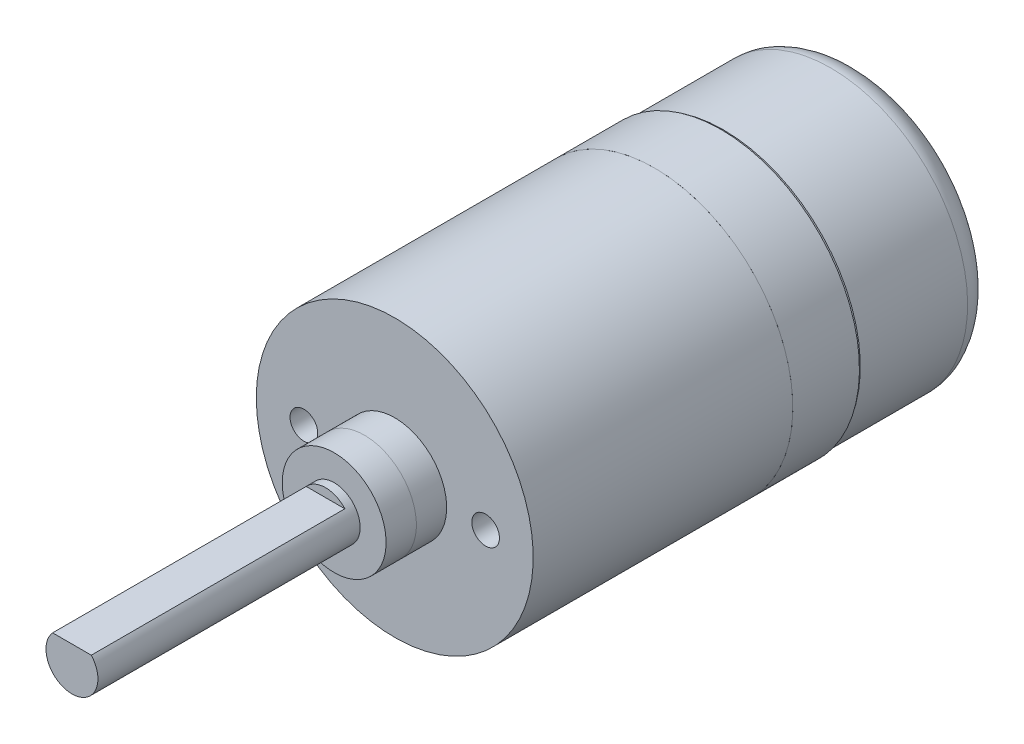
ISO-10303-21;
HEADER;
FILE_DESCRIPTION(('STEP AP214'),'2;1');
FILE_NAME('part.step','',(''),(''),'','','');
FILE_SCHEMA(('AUTOMOTIVE_DESIGN { 1 0 10303 214 1 1 1 1 }'));
ENDSEC;
DATA;
#1=APPLICATION_CONTEXT('core data for automotive mechanical design processes');
#2=APPLICATION_PROTOCOL_DEFINITION('international standard','automotive_design',2000,#1);
#3=PRODUCT_CONTEXT('',#1,'mechanical');
#4=PRODUCT('Part','Part','',(#3));
#5=PRODUCT_RELATED_PRODUCT_CATEGORY('part','',(#4));
#6=PRODUCT_DEFINITION_FORMATION('','',#4);
#7=PRODUCT_DEFINITION_CONTEXT('part definition',#1,'design');
#8=PRODUCT_DEFINITION('design','',#6,#7);
#9=PRODUCT_DEFINITION_SHAPE('','',#8);
#10=(LENGTH_UNIT() NAMED_UNIT(*) SI_UNIT(.MILLI.,.METRE.));
#11=(NAMED_UNIT(*) PLANE_ANGLE_UNIT() SI_UNIT($,.RADIAN.));
#12=(NAMED_UNIT(*) SI_UNIT($,.STERADIAN.) SOLID_ANGLE_UNIT());
#13=UNCERTAINTY_MEASURE_WITH_UNIT(LENGTH_MEASURE(1.E-05),#10,'distance_accuracy_value','');
#14=(GEOMETRIC_REPRESENTATION_CONTEXT(3) GLOBAL_UNCERTAINTY_ASSIGNED_CONTEXT((#13)) GLOBAL_UNIT_ASSIGNED_CONTEXT((#10,
#11,#12)) REPRESENTATION_CONTEXT('',''));
#15=CARTESIAN_POINT('',(0.,0.,0.));
#16=DIRECTION('',(0.,0.,1.));
#17=DIRECTION('',(1.,0.,0.));
#18=AXIS2_PLACEMENT_3D('',#15,#16,#17);
#19=CARTESIAN_POINT('',(-1.11803398874988,1.,19.));
#20=DIRECTION('',(0.,-1.,0.));
#21=DIRECTION('',(0.,0.,-1.));
#22=AXIS2_PLACEMENT_3D('',#19,#20,#21);
#23=PLANE('',#22);
#24=DIRECTION('',(-1.,0.,0.));
#25=VECTOR('',#24,1.);
#26=CARTESIAN_POINT('',(-1.11803398874988,1.,33.65));
#27=LINE('',#26,#25);
#28=CARTESIAN_POINT('',(1.11803398874989,1.00000000000001,33.65));
#29=VERTEX_POINT('',#28);
#30=CARTESIAN_POINT('',(-1.11803398874988,1.,33.65));
#31=VERTEX_POINT('',#30);
#32=EDGE_CURVE('P0_E62',#29,#31,#27,.T.);
#33=ORIENTED_EDGE('',*,*,#32,.F.);
#34=DIRECTION('',(0.,0.,1.));
#35=VECTOR('',#34,1.);
#36=CARTESIAN_POINT('',(1.11803398874988,1.,19.));
#37=LINE('',#36,#35);
#38=CARTESIAN_POINT('',(1.11803398874988,1.,19.));
#39=VERTEX_POINT('',#38);
#40=EDGE_CURVE('P0_E127',#39,#29,#37,.T.);
#41=ORIENTED_EDGE('',*,*,#40,.F.);
#42=DIRECTION('',(1.,0.,0.));
#43=VECTOR('',#42,1.);
#44=CARTESIAN_POINT('',(-1.11803398874988,1.,19.));
#45=LINE('',#44,#43);
#46=CARTESIAN_POINT('',(-1.11803398874988,1.,19.));
#47=VERTEX_POINT('',#46);
#48=EDGE_CURVE('P0_E147',#47,#39,#45,.T.);
#49=ORIENTED_EDGE('',*,*,#48,.F.);
#50=DIRECTION('',(0.,0.,1.));
#51=VECTOR('',#50,1.);
#52=CARTESIAN_POINT('',(-1.11803398874988,1.,19.));
#53=LINE('',#52,#51);
#54=EDGE_CURVE('P0_E129',#47,#31,#53,.T.);
#55=ORIENTED_EDGE('',*,*,#54,.T.);
#56=EDGE_LOOP('',(#33,#41,#49,#55));
#57=FACE_BOUND('',#56,.T.);
#58=ADVANCED_FACE('P0_F45',(#57),#23,.F.);
#59=CARTESIAN_POINT('',(0.,0.,0.));
#60=DIRECTION('',(0.,0.,-1.));
#61=DIRECTION('',(-1.,0.,0.));
#62=AXIS2_PLACEMENT_3D('',#59,#60,#61);
#63=CYLINDRICAL_SURFACE('',#62,1.5);
#64=CARTESIAN_POINT('',(0.,0.,18.5));
#65=DIRECTION('',(0.,0.,-1.));
#66=DIRECTION('',(-1.,0.,0.));
#67=AXIS2_PLACEMENT_3D('',#64,#65,#66);
#68=CIRCLE('',#67,1.5);
#69=CARTESIAN_POINT('',(-1.5,0.,18.5));
#70=VERTEX_POINT('',#69);
#71=EDGE_CURVE('P0_E152',#70,#70,#68,.T.);
#72=ORIENTED_EDGE('',*,*,#71,.F.);
#73=EDGE_LOOP('',(#72));
#74=FACE_BOUND('',#73,.T.);
#75=ORIENTED_EDGE('',*,*,#40,.T.);
#76=CARTESIAN_POINT('',(0.,0.,33.65));
#77=DIRECTION('',(0.,0.,1.));
#78=DIRECTION('',(1.,0.,0.));
#79=AXIS2_PLACEMENT_3D('',#76,#77,#78);
#80=CIRCLE('',#79,1.5);
#81=EDGE_CURVE('P0_E118',#31,#29,#80,.T.);
#82=ORIENTED_EDGE('',*,*,#81,.F.);
#83=ORIENTED_EDGE('',*,*,#54,.F.);
#84=CARTESIAN_POINT('',(0.,0.,19.));
#85=DIRECTION('',(0.,0.,1.));
#86=DIRECTION('',(1.,0.,0.));
#87=AXIS2_PLACEMENT_3D('',#84,#85,#86);
#88=CIRCLE('',#87,1.5);
#89=EDGE_CURVE('P0_E134',#39,#47,#88,.T.);
#90=ORIENTED_EDGE('',*,*,#89,.F.);
#91=EDGE_LOOP('',(#75,#82,#83,#90));
#92=FACE_BOUND('',#91,.T.);
#93=ADVANCED_FACE('P0_F132',(#74,#92),#63,.T.);
#94=CARTESIAN_POINT('',(-5.25,0.,15.));
#95=DIRECTION('',(0.,0.,1.));
#96=DIRECTION('',(1.,0.,0.));
#97=AXIS2_PLACEMENT_3D('',#94,#95,#96);
#98=CYLINDRICAL_SURFACE('',#97,0.8);
#99=CARTESIAN_POINT('',(-5.25,0.,12.5));
#100=DIRECTION('',(0.,0.,1.));
#101=DIRECTION('',(1.,0.,0.));
#102=AXIS2_PLACEMENT_3D('',#99,#100,#101);
#103=CIRCLE('',#102,0.8);
#104=CARTESIAN_POINT('',(-4.45,0.,12.5));
#105=VERTEX_POINT('',#104);
#106=EDGE_CURVE('P0_E11',#105,#105,#103,.T.);
#107=ORIENTED_EDGE('',*,*,#106,.F.);
#108=EDGE_LOOP('',(#107));
#109=FACE_BOUND('',#108,.T.);
#110=CARTESIAN_POINT('',(-5.25,0.,15.));
#111=DIRECTION('',(0.,0.,1.));
#112=DIRECTION('',(1.,0.,0.));
#113=AXIS2_PLACEMENT_3D('',#110,#111,#112);
#114=CIRCLE('',#113,0.8);
#115=CARTESIAN_POINT('',(-4.45,0.,15.));
#116=VERTEX_POINT('',#115);
#117=EDGE_CURVE('P0_E159',#116,#116,#114,.T.);
#118=ORIENTED_EDGE('',*,*,#117,.T.);
#119=EDGE_LOOP('',(#118));
#120=FACE_BOUND('',#119,.T.);
#121=ADVANCED_FACE('P0_F196',(#109,#120),#98,.F.);
#122=CARTESIAN_POINT('',(-5.25,0.,12.5));
#123=DIRECTION('',(0.,0.,1.));
#124=DIRECTION('',(1.,0.,0.));
#125=AXIS2_PLACEMENT_3D('',#122,#123,#124);
#126=CONICAL_SURFACE('',#125,0.8,1.02974425867665);
#127=CARTESIAN_POINT('',(-5.25,0.,12.0193115047779));
#128=VERTEX_POINT('',#127);
#129=VERTEX_LOOP('',#128);
#130=FACE_BOUND('',#129,.T.);
#131=ORIENTED_EDGE('',*,*,#106,.T.);
#132=EDGE_LOOP('',(#131));
#133=FACE_BOUND('',#132,.T.);
#134=ADVANCED_FACE('P0_F212',(#130,#133),#126,.F.);
#135=CARTESIAN_POINT('',(5.25,0.,15.));
#136=DIRECTION('',(0.,0.,1.));
#137=DIRECTION('',(1.,0.,0.));
#138=AXIS2_PLACEMENT_3D('',#135,#136,#137);
#139=CYLINDRICAL_SURFACE('',#138,0.8);
#140=CARTESIAN_POINT('',(5.25,0.,12.5));
#141=DIRECTION('',(0.,0.,1.));
#142=DIRECTION('',(1.,0.,0.));
#143=AXIS2_PLACEMENT_3D('',#140,#141,#142);
#144=CIRCLE('',#143,0.8);
#145=CARTESIAN_POINT('',(6.05,0.,12.5));
#146=VERTEX_POINT('',#145);
#147=EDGE_CURVE('P0_E55',#146,#146,#144,.T.);
#148=ORIENTED_EDGE('',*,*,#147,.F.);
#149=EDGE_LOOP('',(#148));
#150=FACE_BOUND('',#149,.T.);
#151=CARTESIAN_POINT('',(5.25,0.,15.));
#152=DIRECTION('',(0.,0.,1.));
#153=DIRECTION('',(1.,0.,0.));
#154=AXIS2_PLACEMENT_3D('',#151,#152,#153);
#155=CIRCLE('',#154,0.8);
#156=CARTESIAN_POINT('',(6.05,0.,15.));
#157=VERTEX_POINT('',#156);
#158=EDGE_CURVE('P0_E156',#157,#157,#155,.T.);
#159=ORIENTED_EDGE('',*,*,#158,.T.);
#160=EDGE_LOOP('',(#159));
#161=FACE_BOUND('',#160,.T.);
#162=ADVANCED_FACE('P0_F47',(#150,#161),#139,.F.);
#163=CARTESIAN_POINT('',(5.25,0.,12.5));
#164=DIRECTION('',(0.,0.,1.));
#165=DIRECTION('',(1.,0.,0.));
#166=AXIS2_PLACEMENT_3D('',#163,#164,#165);
#167=CONICAL_SURFACE('',#166,0.8,1.02974425867665);
#168=CARTESIAN_POINT('',(5.25,0.,12.0193115047779));
#169=VERTEX_POINT('',#168);
#170=VERTEX_LOOP('',#169);
#171=FACE_BOUND('',#170,.T.);
#172=ORIENTED_EDGE('',*,*,#147,.T.);
#173=EDGE_LOOP('',(#172));
#174=FACE_BOUND('',#173,.T.);
#175=ADVANCED_FACE('P0_F204',(#171,#174),#167,.F.);
#176=CARTESIAN_POINT('',(0.,0.,19.));
#177=DIRECTION('',(0.,0.,1.));
#178=DIRECTION('',(1.,0.,0.));
#179=AXIS2_PLACEMENT_3D('',#176,#177,#178);
#180=PLANE('',#179);
#181=ORIENTED_EDGE('',*,*,#89,.T.);
#182=ORIENTED_EDGE('',*,*,#48,.T.);
#183=EDGE_LOOP('',(#181,#182));
#184=FACE_BOUND('',#183,.T.);
#185=ADVANCED_FACE('P0_F201',(#184),#180,.T.);
#186=CARTESIAN_POINT('',(0.,8.,0.));
#187=DIRECTION('',(0.,0.,-1.));
#188=DIRECTION('',(0.,-1.,0.));
#189=AXIS2_PLACEMENT_3D('',#186,#187,#188);
#190=PLANE('',#189);
#191=CARTESIAN_POINT('',(0.,0.,0.));
#192=DIRECTION('',(0.,0.,-1.));
#193=DIRECTION('',(-1.,0.,0.));
#194=AXIS2_PLACEMENT_3D('',#191,#192,#193);
#195=CIRCLE('',#194,8.);
#196=CARTESIAN_POINT('',(-8.,0.,0.));
#197=VERTEX_POINT('',#196);
#198=EDGE_CURVE('P0_E150',#197,#197,#195,.T.);
#199=ORIENTED_EDGE('',*,*,#198,.T.);
#200=EDGE_LOOP('',(#199));
#201=FACE_BOUND('',#200,.T.);
#202=ADVANCED_FACE('P0_F203',(#201),#190,.T.);
#203=CARTESIAN_POINT('',(0.,0.,0.));
#204=DIRECTION('',(0.,0.,-1.));
#205=DIRECTION('',(-1.,0.,0.));
#206=AXIS2_PLACEMENT_3D('',#203,#204,#205);
#207=CYLINDRICAL_SURFACE('',#206,8.);
#208=CARTESIAN_POINT('',(0.,0.,15.));
#209=DIRECTION('',(0.,0.,-1.));
#210=DIRECTION('',(-1.,0.,0.));
#211=AXIS2_PLACEMENT_3D('',#208,#209,#210);
#212=CIRCLE('',#211,8.);
#213=CARTESIAN_POINT('',(-8.,0.,15.));
#214=VERTEX_POINT('',#213);
#215=EDGE_CURVE('P0_E49',#214,#214,#212,.T.);
#216=ORIENTED_EDGE('',*,*,#215,.T.);
#217=EDGE_LOOP('',(#216));
#218=FACE_BOUND('',#217,.T.);
#219=ORIENTED_EDGE('',*,*,#198,.F.);
#220=EDGE_LOOP('',(#219));
#221=FACE_BOUND('',#220,.T.);
#222=ADVANCED_FACE('P0_F199',(#218,#221),#207,.T.);
#223=CARTESIAN_POINT('',(0.,3.,15.));
#224=DIRECTION('',(0.,0.,1.));
#225=DIRECTION('',(1.,0.,0.));
#226=AXIS2_PLACEMENT_3D('',#223,#224,#225);
#227=PLANE('',#226);
#228=CARTESIAN_POINT('',(0.,0.,15.));
#229=DIRECTION('',(0.,0.,-1.));
#230=DIRECTION('',(-1.,0.,0.));
#231=AXIS2_PLACEMENT_3D('',#228,#229,#230);
#232=CIRCLE('',#231,3.);
#233=CARTESIAN_POINT('',(-3.,0.,15.));
#234=VERTEX_POINT('',#233);
#235=EDGE_CURVE('P0_E136',#234,#234,#232,.T.);
#236=ORIENTED_EDGE('',*,*,#235,.T.);
#237=EDGE_LOOP('',(#236));
#238=FACE_BOUND('',#237,.T.);
#239=ORIENTED_EDGE('',*,*,#158,.F.);
#240=EDGE_LOOP('',(#239));
#241=FACE_BOUND('',#240,.T.);
#242=ORIENTED_EDGE('',*,*,#117,.F.);
#243=EDGE_LOOP('',(#242));
#244=FACE_BOUND('',#243,.T.);
#245=ORIENTED_EDGE('',*,*,#215,.F.);
#246=EDGE_LOOP('',(#245));
#247=FACE_BOUND('',#246,.T.);
#248=ADVANCED_FACE('P0_F185',(#238,#241,#244,#247),#227,.T.);
#249=CARTESIAN_POINT('',(0.,0.,0.));
#250=DIRECTION('',(0.,0.,-1.));
#251=DIRECTION('',(-1.,0.,0.));
#252=AXIS2_PLACEMENT_3D('',#249,#250,#251);
#253=CYLINDRICAL_SURFACE('',#252,3.);
#254=CARTESIAN_POINT('',(0.,0.,16.75));
#255=DIRECTION('',(0.,0.,1.));
#256=DIRECTION('',(-1.,0.,0.));
#257=AXIS2_PLACEMENT_3D('',#254,#255,#256);
#258=CIRCLE('',#257,3.);
#259=CARTESIAN_POINT('',(-3.,0.,16.75));
#260=VERTEX_POINT('',#259);
#261=EDGE_CURVE('P0_E130',#260,#260,#258,.T.);
#262=ORIENTED_EDGE('',*,*,#261,.F.);
#263=EDGE_LOOP('',(#262));
#264=FACE_BOUND('',#263,.T.);
#265=ORIENTED_EDGE('',*,*,#235,.F.);
#266=EDGE_LOOP('',(#265));
#267=FACE_BOUND('',#266,.T.);
#268=ADVANCED_FACE('P0_F175',(#264,#267),#253,.T.);
#269=CARTESIAN_POINT('',(0.,1.5,18.5));
#270=DIRECTION('',(0.,0.,1.));
#271=DIRECTION('',(1.,0.,0.));
#272=AXIS2_PLACEMENT_3D('',#269,#270,#271);
#273=PLANE('',#272);
#274=ORIENTED_EDGE('',*,*,#71,.T.);
#275=EDGE_LOOP('',(#274));
#276=FACE_BOUND('',#275,.T.);
#277=CARTESIAN_POINT('',(0.,0.,18.5));
#278=DIRECTION('',(0.,0.,-1.));
#279=DIRECTION('',(-1.,0.,0.));
#280=AXIS2_PLACEMENT_3D('',#277,#278,#279);
#281=CIRCLE('',#280,3.);
#282=CARTESIAN_POINT('',(-3.,0.,18.5));
#283=VERTEX_POINT('',#282);
#284=EDGE_CURVE('P0_E145',#283,#283,#281,.T.);
#285=ORIENTED_EDGE('',*,*,#284,.F.);
#286=EDGE_LOOP('',(#285));
#287=FACE_BOUND('',#286,.T.);
#288=ADVANCED_FACE('P0_F173',(#276,#287),#273,.T.);
#289=CARTESIAN_POINT('',(0.,0.,0.));
#290=DIRECTION('',(0.,0.,-1.));
#291=DIRECTION('',(-1.,0.,0.));
#292=AXIS2_PLACEMENT_3D('',#289,#290,#291);
#293=CYLINDRICAL_SURFACE('',#292,3.);
#294=ORIENTED_EDGE('',*,*,#284,.T.);
#295=EDGE_LOOP('',(#294));
#296=FACE_BOUND('',#295,.T.);
#297=ORIENTED_EDGE('',*,*,#261,.T.);
#298=EDGE_LOOP('',(#297));
#299=FACE_BOUND('',#298,.T.);
#300=ADVANCED_FACE('P0_F170',(#296,#299),#293,.T.);
#301=CARTESIAN_POINT('',(0.,0.,33.65));
#302=DIRECTION('',(0.,0.,1.));
#303=DIRECTION('',(1.,0.,0.));
#304=AXIS2_PLACEMENT_3D('',#301,#302,#303);
#305=PLANE('',#304);
#306=ORIENTED_EDGE('',*,*,#32,.T.);
#307=ORIENTED_EDGE('',*,*,#81,.T.);
#308=EDGE_LOOP('',(#306,#307));
#309=FACE_BOUND('',#308,.T.);
#310=ADVANCED_FACE('P0_F119',(#309),#305,.T.);
#311=CLOSED_SHELL('',(#58,#93,#121,#134,#162,#175,#185,#202,#222,#248,#268,#288,#300,#310));
#312=MANIFOLD_SOLID_BREP('P0_B2',#311);
#313=CARTESIAN_POINT('',(0.,0.,0.));
#314=DIRECTION('',(0.,0.,-1.));
#315=DIRECTION('',(0.,1.,0.));
#316=AXIS2_PLACEMENT_3D('',#313,#314,#315);
#317=CYLINDRICAL_SURFACE('',#316,6.);
#318=CARTESIAN_POINT('',(0.,0.,-3.85));
#319=DIRECTION('',(0.,0.,-1.));
#320=DIRECTION('',(0.,1.,0.));
#321=AXIS2_PLACEMENT_3D('',#318,#319,#320);
#322=CIRCLE('',#321,6.);
#323=CARTESIAN_POINT('',(0.,6.,-3.85));
#324=VERTEX_POINT('',#323);
#325=EDGE_CURVE('P1_E11',#324,#324,#322,.T.);
#326=ORIENTED_EDGE('',*,*,#325,.T.);
#327=EDGE_LOOP('',(#326));
#328=FACE_BOUND('',#327,.T.);
#329=CARTESIAN_POINT('',(0.,0.,-9.85));
#330=DIRECTION('',(0.,0.,-1.));
#331=DIRECTION('',(0.,1.,0.));
#332=AXIS2_PLACEMENT_3D('',#329,#330,#331);
#333=CIRCLE('',#332,6.);
#334=CARTESIAN_POINT('',(0.,6.,-9.85));
#335=VERTEX_POINT('',#334);
#336=EDGE_CURVE('P1_E46',#335,#335,#333,.T.);
#337=ORIENTED_EDGE('',*,*,#336,.F.);
#338=EDGE_LOOP('',(#337));
#339=FACE_BOUND('',#338,.T.);
#340=ADVANCED_FACE('P1_F17',(#328,#339),#317,.T.);
#341=CARTESIAN_POINT('',(0.,8.,-3.85));
#342=DIRECTION('',(0.,0.,-1.));
#343=DIRECTION('',(-1.,0.,0.));
#344=AXIS2_PLACEMENT_3D('',#341,#342,#343);
#345=PLANE('',#344);
#346=ORIENTED_EDGE('',*,*,#325,.F.);
#347=EDGE_LOOP('',(#346));
#348=FACE_BOUND('',#347,.T.);
#349=CARTESIAN_POINT('',(0.,0.,-3.85));
#350=DIRECTION('',(0.,0.,-1.));
#351=DIRECTION('',(0.,1.,0.));
#352=AXIS2_PLACEMENT_3D('',#349,#350,#351);
#353=CIRCLE('',#352,8.);
#354=CARTESIAN_POINT('',(0.,8.,-3.85));
#355=VERTEX_POINT('',#354);
#356=EDGE_CURVE('P1_E26',#355,#355,#353,.T.);
#357=ORIENTED_EDGE('',*,*,#356,.T.);
#358=EDGE_LOOP('',(#357));
#359=FACE_BOUND('',#358,.T.);
#360=ADVANCED_FACE('P1_F90',(#348,#359),#345,.T.);
#361=CARTESIAN_POINT('',(0.,0.,0.));
#362=DIRECTION('',(0.,0.,-1.));
#363=DIRECTION('',(0.,1.,0.));
#364=AXIS2_PLACEMENT_3D('',#361,#362,#363);
#365=CYLINDRICAL_SURFACE('',#364,8.);
#366=CARTESIAN_POINT('',(0.,0.,0.));
#367=DIRECTION('',(0.,0.,-1.));
#368=DIRECTION('',(0.,1.,0.));
#369=AXIS2_PLACEMENT_3D('',#366,#367,#368);
#370=CIRCLE('',#369,8.);
#371=CARTESIAN_POINT('',(0.,8.,0.));
#372=VERTEX_POINT('',#371);
#373=EDGE_CURVE('P1_E53',#372,#372,#370,.T.);
#374=ORIENTED_EDGE('',*,*,#373,.T.);
#375=EDGE_LOOP('',(#374));
#376=FACE_BOUND('',#375,.T.);
#377=ORIENTED_EDGE('',*,*,#356,.F.);
#378=EDGE_LOOP('',(#377));
#379=FACE_BOUND('',#378,.T.);
#380=ADVANCED_FACE('P1_F54',(#376,#379),#365,.T.);
#381=CARTESIAN_POINT('',(0.,0.,0.));
#382=DIRECTION('',(0.,0.,1.));
#383=DIRECTION('',(0.,-1.,0.));
#384=AXIS2_PLACEMENT_3D('',#381,#382,#383);
#385=PLANE('',#384);
#386=ORIENTED_EDGE('',*,*,#373,.F.);
#387=EDGE_LOOP('',(#386));
#388=FACE_BOUND('',#387,.T.);
#389=ADVANCED_FACE('P1_F82',(#388),#385,.T.);
#390=CARTESIAN_POINT('',(0.,6.,-9.85));
#391=DIRECTION('',(0.,0.,-1.));
#392=DIRECTION('',(-1.,0.,0.));
#393=AXIS2_PLACEMENT_3D('',#390,#391,#392);
#394=PLANE('',#393);
#395=ORIENTED_EDGE('',*,*,#336,.T.);
#396=EDGE_LOOP('',(#395));
#397=FACE_BOUND('',#396,.T.);
#398=ADVANCED_FACE('P1_F77',(#397),#394,.T.);
#399=CLOSED_SHELL('',(#340,#360,#380,#389,#398));
#400=MANIFOLD_SOLID_BREP('P1_B1',#399);
#401=CARTESIAN_POINT('',(0.,4.9,-12.2));
#402=CARTESIAN_POINT('',(0.641408495655411,4.9,-12.2));
#403=CARTESIAN_POINT('',(1.28256463747401,4.77246611397071,-12.2));
#404=CARTESIAN_POINT('',(2.46773299970387,4.2815533046399,-12.2));
#405=CARTESIAN_POINT('',(3.01127893102555,3.9183675246029,-12.2));
#406=CARTESIAN_POINT('',(3.91836752460263,3.01127893102527,-12.2));
#407=CARTESIAN_POINT('',(4.28155330463977,2.46773299970391,-12.2));
#408=CARTESIAN_POINT('',(4.77246611397085,1.28256463747397,-12.2));
#409=CARTESIAN_POINT('',(4.9,0.641408495655548,-12.2));
#410=CARTESIAN_POINT('',(4.9,-0.641408495655544,-12.2));
#411=CARTESIAN_POINT('',(4.77246611397084,-1.28256463747397,-12.2));
#412=CARTESIAN_POINT('',(4.28155330463977,-2.46773299970392,-12.2));
#413=CARTESIAN_POINT('',(3.91836752460279,-3.01127893102551,-12.2));
#414=CARTESIAN_POINT('',(3.01127893102537,-3.91836752460266,-12.2));
#415=CARTESIAN_POINT('',(2.4677329997039,-4.28155330463975,-12.2));
#416=CARTESIAN_POINT('',(1.28256463747399,-4.77246611397085,-12.2));
#417=CARTESIAN_POINT('',(0.641408495655546,-4.9,-12.2));
#418=CARTESIAN_POINT('',(-0.641408495655545,-4.9,-12.2));
#419=CARTESIAN_POINT('',(-1.28256463747391,-4.77246611397114,-12.2));
#420=CARTESIAN_POINT('',(-2.46773299970396,-4.28155330463948,-12.2));
#421=CARTESIAN_POINT('',(-3.01127893102537,-3.91836752460265,-12.2));
#422=CARTESIAN_POINT('',(-3.91836752460279,-3.01127893102551,-12.2));
#423=CARTESIAN_POINT('',(-4.28155330463977,-2.46773299970394,-12.2));
#424=CARTESIAN_POINT('',(-4.77246611397083,-1.28256463747395,-12.2));
#425=CARTESIAN_POINT('',(-4.9,-0.641408495655537,-12.2));
#426=CARTESIAN_POINT('',(-4.9,0.641408495655556,-12.2));
#427=CARTESIAN_POINT('',(-4.77246611397111,1.28256463747387,-12.2));
#428=CARTESIAN_POINT('',(-4.28155330463951,2.467732999704,-12.2));
#429=CARTESIAN_POINT('',(-3.91836752460281,3.01127893102535,-12.2));
#430=CARTESIAN_POINT('',(-3.01127893102537,3.91836752460279,-12.2));
#431=CARTESIAN_POINT('',(-2.46773299970401,4.28155330463977,-12.2));
#432=CARTESIAN_POINT('',(-1.28256463747389,4.77246611397083,-12.2));
#433=CARTESIAN_POINT('',(-0.641408495655412,4.9,-12.2));
#434=CARTESIAN_POINT('',(0.,4.9,-12.2));
#435=CARTESIAN_POINT('',(0.,7.9,-12.2));
#436=CARTESIAN_POINT('',(1.03410757462811,7.89999999999944,-12.2));
#437=CARTESIAN_POINT('',(2.06780829307035,7.69438414293231,-12.2));
#438=CARTESIAN_POINT('',(3.97858993829807,6.90291247074602,-12.2));
#439=CARTESIAN_POINT('',(4.85491909287788,6.31736804986957,-12.2));
#440=CARTESIAN_POINT('',(6.31736804986957,4.85491909287788,-12.2));
#441=CARTESIAN_POINT('',(6.90291247074581,3.97858993829803,-12.2));
#442=CARTESIAN_POINT('',(7.69438414293252,2.06780829307038,-12.2));
#443=CARTESIAN_POINT('',(7.9,1.03410757462833,-12.2));
#444=CARTESIAN_POINT('',(7.9,-1.03410757462833,-12.2));
#445=CARTESIAN_POINT('',(7.69438414293252,-2.06780829307025,-12.2));
#446=CARTESIAN_POINT('',(6.90291247074581,-3.97858993829817,-12.2));
#447=CARTESIAN_POINT('',(6.31736804986972,-4.85491909287773,-12.2000000000005));
#448=CARTESIAN_POINT('',(4.85491909287772,-6.31736804986972,-12.1999999999994));
#449=CARTESIAN_POINT('',(3.97858993829798,-6.90291247074568,-12.2));
#450=CARTESIAN_POINT('',(2.06780829307046,-7.69438414293265,-12.2));
#451=CARTESIAN_POINT('',(1.03410757462833,-7.9,-12.2));
#452=CARTESIAN_POINT('',(-1.03410757462833,-7.9,-12.2));
#453=CARTESIAN_POINT('',(-2.06780829307016,-7.69438414293265,-12.2));
#454=CARTESIAN_POINT('',(-3.97858993829823,-6.90291247074568,-12.2));
#455=CARTESIAN_POINT('',(-4.85491909287773,-6.31736804986972,-12.2));
#456=CARTESIAN_POINT('',(-6.31736804986973,-4.85491909287773,-12.2));
#457=CARTESIAN_POINT('',(-6.90291247074592,-3.97858993829838,-12.2));
#458=CARTESIAN_POINT('',(-7.69438414293239,-2.06780829307005,-12.2));
#459=CARTESIAN_POINT('',(-7.9,-1.03410757462832,-12.2));
#460=CARTESIAN_POINT('',(-7.9,1.03410757462834,-12.2));
#461=CARTESIAN_POINT('',(-7.69438414293296,2.06780829307017,-12.2));
#462=CARTESIAN_POINT('',(-6.90291247074538,3.97858993829823,-12.2));
#463=CARTESIAN_POINT('',(-6.31736804986993,4.85491909287723,-12.2));
#464=CARTESIAN_POINT('',(-4.85491909287754,6.31736804987018,-12.2));
#465=CARTESIAN_POINT('',(-3.97858993829839,6.90291247074565,-12.2));
#466=CARTESIAN_POINT('',(-2.06780829307005,7.69438414293268,-12.2));
#467=CARTESIAN_POINT('',(-1.03410757462811,7.90000000000055,-12.2));
#468=CARTESIAN_POINT('',(0.,7.9,-12.2));
#469=CARTESIAN_POINT('',(0.,7.9,-10.2));
#470=CARTESIAN_POINT('',(1.03410757462811,7.9,-10.2));
#471=CARTESIAN_POINT('',(2.06780829307046,7.69438414293257,-10.2));
#472=CARTESIAN_POINT('',(3.97858993829796,6.90291247074576,-10.2));
#473=CARTESIAN_POINT('',(4.85491909287789,6.31736804986957,-10.2));
#474=CARTESIAN_POINT('',(6.31736804986957,4.85491909287789,-10.2));
#475=CARTESIAN_POINT('',(6.90291247074575,3.978589938298,-10.2));
#476=CARTESIAN_POINT('',(7.69438414293259,2.06780829307041,-10.2));
#477=CARTESIAN_POINT('',(7.9,1.03410757462833,-10.2));
#478=CARTESIAN_POINT('',(7.9,-1.03410757462833,-10.2));
#479=CARTESIAN_POINT('',(7.69438414293264,-2.0678082930703,-10.2));
#480=CARTESIAN_POINT('',(6.90291247074569,-3.97858993829813,-10.2));
#481=CARTESIAN_POINT('',(6.31736804986972,-4.85491909287773,-10.2));
#482=CARTESIAN_POINT('',(4.85491909287772,-6.31736804986973,-10.2));
#483=CARTESIAN_POINT('',(3.978589938298,-6.90291247074574,-10.2));
#484=CARTESIAN_POINT('',(2.06780829307043,-7.69438414293258,-10.2));
#485=CARTESIAN_POINT('',(1.03410757462833,-7.9,-10.2));
#486=CARTESIAN_POINT('',(-1.03410757462833,-7.9,-10.2));
#487=CARTESIAN_POINT('',(-2.06780829307018,-7.69438414293268,-10.2));
#488=CARTESIAN_POINT('',(-3.97858993829822,-6.90291247074566,-10.2));
#489=CARTESIAN_POINT('',(-4.85491909287773,-6.31736804986972,-10.2));
#490=CARTESIAN_POINT('',(-6.31736804986973,-4.85491909287772,-10.2));
#491=CARTESIAN_POINT('',(-6.90291247074569,-3.97858993829815,-10.2));
#492=CARTESIAN_POINT('',(-7.69438414293264,-2.06780829307029,-10.2));
#493=CARTESIAN_POINT('',(-7.9,-1.03410757462832,-10.2));
#494=CARTESIAN_POINT('',(-7.9,1.03410757462834,-10.2));
#495=CARTESIAN_POINT('',(-7.69438414293273,2.06780829307008,-10.2));
#496=CARTESIAN_POINT('',(-6.90291247074561,3.97858993829832,-10.2));
#497=CARTESIAN_POINT('',(-6.31736804986994,4.85491909287751,-10.2));
#498=CARTESIAN_POINT('',(-4.85491909287754,6.31736804986991,-10.2));
#499=CARTESIAN_POINT('',(-3.97858993829836,6.9029124707456,-10.2));
#500=CARTESIAN_POINT('',(-2.06780829307008,7.69438414293273,-10.2));
#501=CARTESIAN_POINT('',(-1.03410757462811,7.9,-10.2));
#502=CARTESIAN_POINT('',(0.,7.9,-10.2));
#503=(BOUNDED_SURFACE() B_SPLINE_SURFACE(2,3,((#401,#402,#403,#404,#405,#406,#407,#408,#409,
#410,#411,#412,#413,#414,#415,#416,#417,#418,#419,#420,#421,#422,#423,#424,#425,#426,#427,#428,
#429,#430,#431,#432,#433,#434),(#435,#436,#437,#438,#439,#440,#441,#442,#443,#444,#445,#446,
#447,#448,#449,#450,#451,#452,#453,#454,#455,#456,#457,#458,#459,#460,#461,#462,#463,#464,#465,
#466,#467,#468),(#469,#470,#471,#472,#473,#474,#475,#476,#477,#478,#479,#480,#481,#482,#483,
#484,#485,#486,#487,#488,#489,#490,#491,#492,#493,#494,#495,#496,#497,#498,#499,#500,#501,
#502)),.UNSPECIFIED.,.F.,.T.,.F.) B_SPLINE_SURFACE_WITH_KNOTS((3,3),(4,2,2,2,2,2,2,2,2,2,2,2,2,
2,2,2,4),(0.,1.),(0.,0.392699081698724,0.785398163397448,1.17809724509617,1.5707963267949,
1.96349540849362,2.35619449019234,2.74889357189107,3.1415926535898,3.53429173528852,
3.92699081698724,4.31968989868597,4.71238898038469,5.10508806208341,5.49778714378214,
5.89048622548086,6.28318530717959),
.UNSPECIFIED.) GEOMETRIC_REPRESENTATION_ITEM() RATIONAL_B_SPLINE_SURFACE(((1.,1.,1.,1.,1.,1.,1.,
1.,1.,1.,1.,1.,1.,1.,1.,1.,1.,1.,1.,1.,1.,1.,1.,1.,1.,1.,1.,1.,1.,1.,1.,1.,1.,1.),
(0.707106781186548,0.707106781186548,0.707106781186548,0.707106781186548,0.707106781186548,
0.707106781186548,0.707106781186548,0.707106781186548,0.707106781186548,0.707106781186548,
0.707106781186548,0.707106781186548,0.707106781186548,0.707106781186548,0.707106781186548,
0.707106781186548,0.707106781186548,0.707106781186548,0.707106781186548,0.707106781186548,
0.707106781186547,0.707106781186547,0.707106781186548,0.707106781186548,0.707106781186548,
0.707106781186548,0.707106781186548,0.707106781186548,0.707106781186548,0.707106781186548,
0.707106781186548,0.707106781186548,0.707106781186548,0.707106781186548),(1.,1.,1.,1.,1.,1.,1.,
1.,1.,1.,1.,1.,1.,1.,1.,1.,1.,1.,1.,1.,1.,1.,1.,1.,1.,1.,1.,1.,1.,1.,1.,1.,1.,1.))) REPRESENTATION_ITEM('') SURFACE());
#504=CARTESIAN_POINT('',(0.,7.9,-10.2000000000107));
#505=CARTESIAN_POINT('',(1.03410757462811,7.9,-10.2000000000107));
#506=CARTESIAN_POINT('',(2.06780829307046,7.69438414293257,-10.2000000000107));
#507=CARTESIAN_POINT('',(3.97858993829796,6.90291247074576,-10.2000000000107));
#508=CARTESIAN_POINT('',(4.85491909287789,6.31736804986957,-10.2000000000107));
#509=CARTESIAN_POINT('',(6.31736804986957,4.85491909287789,-10.2000000000107));
#510=CARTESIAN_POINT('',(6.90291247074575,3.978589938298,-10.2000000000107));
#511=CARTESIAN_POINT('',(7.69438414293259,2.06780829307041,-10.2000000000107));
#512=CARTESIAN_POINT('',(7.9,1.03410757462833,-10.2000000000107));
#513=CARTESIAN_POINT('',(7.9,-1.03410757462833,-10.2000000000107));
#514=CARTESIAN_POINT('',(7.69438414293264,-2.06780829307029,-10.2000000000107));
#515=CARTESIAN_POINT('',(6.90291247074569,-3.97858993829812,-10.2000000000107));
#516=CARTESIAN_POINT('',(6.31736804986972,-4.85491909287773,-10.2000000000107));
#517=CARTESIAN_POINT('',(4.85491909287772,-6.31736804986973,-10.2000000000107));
#518=CARTESIAN_POINT('',(3.978589938298,-6.90291247074574,-10.2000000000107));
#519=CARTESIAN_POINT('',(2.06780829307043,-7.69438414293258,-10.2000000000107));
#520=CARTESIAN_POINT('',(1.03410757462833,-7.9,-10.2000000000107));
#521=CARTESIAN_POINT('',(-1.03410757462833,-7.9,-10.2000000000107));
#522=CARTESIAN_POINT('',(-2.06780829307017,-7.69438414293268,-10.2000000000107));
#523=CARTESIAN_POINT('',(-3.97858993829822,-6.90291247074566,-10.2000000000107));
#524=CARTESIAN_POINT('',(-4.85491909287773,-6.31736804986972,-10.2000000000107));
#525=CARTESIAN_POINT('',(-6.31736804986973,-4.85491909287772,-10.2000000000107));
#526=CARTESIAN_POINT('',(-6.90291247074569,-3.97858993829814,-10.2000000000107));
#527=CARTESIAN_POINT('',(-7.69438414293264,-2.06780829307029,-10.2000000000107));
#528=CARTESIAN_POINT('',(-7.9,-1.03410757462832,-10.2000000000107));
#529=CARTESIAN_POINT('',(-7.9,1.03410757462834,-10.2000000000107));
#530=CARTESIAN_POINT('',(-7.69438414293273,2.06780829307007,-10.2000000000107));
#531=CARTESIAN_POINT('',(-6.90291247074561,3.97858993829832,-10.2000000000107));
#532=CARTESIAN_POINT('',(-6.31736804986994,4.85491909287751,-10.2000000000107));
#533=CARTESIAN_POINT('',(-4.85491909287754,6.31736804986991,-10.2000000000107));
#534=CARTESIAN_POINT('',(-3.97858993829836,6.9029124707456,-10.2000000000107));
#535=CARTESIAN_POINT('',(-2.06780829307007,7.69438414293273,-10.2000000000107));
#536=CARTESIAN_POINT('',(-1.03410757462811,7.9,-10.2000000000107));
#537=CARTESIAN_POINT('',(0.,7.9,-10.2000000000107));
#538=(BOUNDED_CURVE() B_SPLINE_CURVE(3,(#504,#505,#506,#507,#508,#509,#510,#511,#512,#513,#514,
#515,#516,#517,#518,#519,#520,#521,#522,#523,#524,#525,#526,#527,#528,#529,#530,#531,#532,#533,
#534,#535,#536,#537),.UNSPECIFIED.,.T.,.F.) B_SPLINE_CURVE_WITH_KNOTS((4,2,2,2,2,2,2,2,2,2,2,2,
2,2,2,2,4),(0.,0.392699081698724,0.785398163397448,1.17809724509617,1.5707963267949,
1.96349540849362,2.35619449019234,2.74889357189107,3.1415926535898,3.53429173528852,
3.92699081698724,4.31968989868597,4.71238898038469,5.10508806208341,5.49778714378214,
5.89048622548086,6.28318530717959),
.UNSPECIFIED.) CURVE() GEOMETRIC_REPRESENTATION_ITEM() RATIONAL_B_SPLINE_CURVE((0.99999999999779,
0.99999999999779,0.99999999999779,0.99999999999779,0.99999999999779,0.99999999999779,
0.99999999999779,0.99999999999779,0.99999999999779,0.99999999999779,0.99999999999779,
0.99999999999779,0.99999999999779,0.99999999999779,0.99999999999779,0.99999999999779,
0.99999999999779,0.99999999999779,0.99999999999779,0.99999999999779,0.99999999999779,
0.99999999999779,0.99999999999779,0.99999999999779,0.99999999999779,0.99999999999779,
0.99999999999779,0.99999999999779,0.99999999999779,0.99999999999779,0.99999999999779,
0.99999999999779,0.99999999999779,0.99999999999779)) REPRESENTATION_ITEM(''));
#539=CARTESIAN_POINT('',(0.,7.9,-10.2));
#540=VERTEX_POINT('',#539);
#541=EDGE_CURVE('P2_E62',#540,#540,#538,.F.);
#542=CARTESIAN_POINT('',(0.,4.9,-12.2));
#543=CARTESIAN_POINT('',(0.320523115376676,4.9,-12.2));
#544=CARTESIAN_POINT('',(0.639679166185058,4.86841199503784,-12.2));
#545=CARTESIAN_POINT('',(0.955883527247151,4.80555100640218,-12.2));
#546=CARTESIAN_POINT('',(1.27208788830924,4.74269001776652,-12.2));
#547=CARTESIAN_POINT('',(1.5791764300156,4.64956681739008,-12.2));
#548=CARTESIAN_POINT('',(1.87514881858894,4.52700970930531,-12.2));
#549=CARTESIAN_POINT('',(2.46709359573562,4.28189549313575,-12.2));
#550=CARTESIAN_POINT('',(3.01173871339578,3.91780669435115,-12.2));
#551=CARTESIAN_POINT('',(3.46482322781408,3.46482322781408,-12.2));
#552=CARTESIAN_POINT('',(3.91790774223239,3.01183976127703,-12.2));
#553=CARTESIAN_POINT('',(4.28176346771578,2.46703890901724,-12.2));
#554=CARTESIAN_POINT('',(4.52700970930531,1.87514881858894,-12.2));
#555=CARTESIAN_POINT('',(4.77225595089483,1.28325872816064,-12.2));
#556=CARTESIAN_POINT('',(4.89992854835809,0.640686813547022,-12.2));
#557=CARTESIAN_POINT('',(4.9,0.,-12.2));
#558=CARTESIAN_POINT('',(4.90007145164192,-0.640686813547019,-12.2));
#559=CARTESIAN_POINT('',(4.77212392547453,-1.28320404144293,-12.2));
#560=CARTESIAN_POINT('',(4.52700970930531,-1.87514881858894,-12.2));
#561=CARTESIAN_POINT('',(4.28189549313608,-2.46709359573495,-12.2));
#562=CARTESIAN_POINT('',(3.91780669435074,-3.01173871339617,-12.2));
#563=CARTESIAN_POINT('',(3.46482322781408,-3.46482322781408,-12.2));
#564=CARTESIAN_POINT('',(3.01183976127742,-3.917907742232,-12.2));
#565=CARTESIAN_POINT('',(2.4670389090125,-4.28176346771672,-12.2));
#566=CARTESIAN_POINT('',(1.87514881858894,-4.5270097093053,-12.2));
#567=CARTESIAN_POINT('',(1.28325872816539,-4.77225595089389,-12.2));
#568=CARTESIAN_POINT('',(0.640686813550465,-4.89992854835808,-12.2));
#569=CARTESIAN_POINT('',(0.,-4.9,-12.2));
#570=CARTESIAN_POINT('',(-0.640686813550464,-4.90007145164192,-12.2));
#571=CARTESIAN_POINT('',(-1.28320404144117,-4.77212392547578,-12.2));
#572=CARTESIAN_POINT('',(-1.87514881858894,-4.52700970930531,-12.2));
#573=CARTESIAN_POINT('',(-2.4670935957367,-4.28189549313484,-12.2));
#574=CARTESIAN_POINT('',(-3.01173871339315,-3.91780669435377,-12.2));
#575=CARTESIAN_POINT('',(-3.46482322781408,-3.46482322781408,-12.2));
#576=CARTESIAN_POINT('',(-3.91790774223502,-3.01183976127439,-12.2));
#577=CARTESIAN_POINT('',(-4.28176346771475,-2.46703890902,-12.2));
#578=CARTESIAN_POINT('',(-4.5270097093053,-1.87514881858894,-12.2));
#579=CARTESIAN_POINT('',(-4.77225595089586,-1.28325872815789,-12.2));
#580=CARTESIAN_POINT('',(-4.89992854835809,-0.640686813550311,-12.2));
#581=CARTESIAN_POINT('',(-4.9,0.,-12.2));
#582=CARTESIAN_POINT('',(-4.90007145164192,0.640686813550331,-12.2));
#583=CARTESIAN_POINT('',(-4.77212392547594,1.28320404144078,-12.2));
#584=CARTESIAN_POINT('',(-4.52700970930531,1.87514881858894,-12.2));
#585=CARTESIAN_POINT('',(-4.28189549313468,2.46709359573708,-12.2));
#586=CARTESIAN_POINT('',(-3.91780669435451,3.01173871339214,-12.2));
#587=CARTESIAN_POINT('',(-3.4648232278141,3.46482322781408,-12.2));
#588=CARTESIAN_POINT('',(-3.01183976127367,3.91790774223601,-12.2));
#589=CARTESIAN_POINT('',(-2.46703890901517,4.28176346771624,-12.2));
#590=CARTESIAN_POINT('',(-1.87514881858894,4.5270097093053,-12.2));
#591=CARTESIAN_POINT('',(-1.57920377337584,4.64963283009984,-12.2));
#592=CARTESIAN_POINT('',(-1.27225403098078,4.74258501067038,-12.2));
#593=CARTESIAN_POINT('',(-0.955883527247105,4.80555100640223,-12.2));
#594=CARTESIAN_POINT('',(-0.639513023513426,4.86851700213408,-12.2));
#595=CARTESIAN_POINT('',(-0.320885181097725,4.9,-12.2));
#596=CARTESIAN_POINT('',(0.,4.9,-12.2));
#597=(BOUNDED_CURVE() B_SPLINE_CURVE(3,(#542,#543,#544,#545,#546,#547,#548,#549,#550,#551,#552,
#553,#554,#555,#556,#557,#558,#559,#560,#561,#562,#563,#564,#565,#566,#567,#568,#569,#570,#571,
#572,#573,#574,#575,#576,#577,#578,#579,#580,#581,#582,#583,#584,#585,#586,#587,#588,#589,#590,
#591,#592,#593,#594,#595,#596),.UNSPECIFIED.,.T.,.F.) B_SPLINE_CURVE_WITH_KNOTS((4,3,3,3,3,3,3,
3,3,3,3,3,3,3,3,3,3,3,4),(0.,0.0555555555555556,0.111111111111111,0.166666666666667,
0.222222222222222,0.277777777777778,0.333333333333334,0.388888888888889,0.444444444444444,0.5,
0.555555555555556,0.611111111111111,0.666666666666667,0.722222222222222,0.777777777777778,
0.833333333333333,0.888888888888889,0.944444444444444,1.),
.UNSPECIFIED.) CURVE() GEOMETRIC_REPRESENTATION_ITEM() RATIONAL_B_SPLINE_CURVE((1.,1.,1.,1.,1.,
1.,1.,1.,1.,1.,1.,1.,1.,1.,1.,1.,1.,1.,1.,1.,1.,1.,1.,1.,1.,1.,1.,1.,1.,1.,1.,1.,1.,1.,1.,1.,1.,
1.,1.,1.,1.,1.,1.,1.,1.,1.,1.,1.,1.,1.,1.,1.,1.,1.,1.)) REPRESENTATION_ITEM(''));
#598=CARTESIAN_POINT('',(0.,4.9,-12.2));
#599=VERTEX_POINT('',#598);
#600=EDGE_CURVE('P2_E11',#599,#599,#597,.T.);
#601=CARTESIAN_POINT('',(0.,4.89986423549801,-12.2));
#602=CARTESIAN_POINT('',(0.641390724123782,4.89986423549801,-12.2));
#603=CARTESIAN_POINT('',(1.28252910140273,4.77233388305536,-12.2));
#604=CARTESIAN_POINT('',(2.46766462612392,4.28143467546599,-12.2));
#605=CARTESIAN_POINT('',(3.01119549739607,3.91825895823237,-12.2));
#606=CARTESIAN_POINT('',(3.9182589582321,3.0111954973958,-12.2));
#607=CARTESIAN_POINT('',(4.28143467546586,2.46766462612396,-12.2));
#608=CARTESIAN_POINT('',(4.7723338830555,1.28252910140269,-12.2));
#609=CARTESIAN_POINT('',(4.89986423549801,0.641390724123919,-12.2));
#610=CARTESIAN_POINT('',(4.89986423549801,-0.641390724123915,-12.2));
#611=CARTESIAN_POINT('',(4.77233388305549,-1.28252910140269,-12.2));
#612=CARTESIAN_POINT('',(4.28143467546586,-2.46766462612397,-12.2));
#613=CARTESIAN_POINT('',(3.91825895823226,-3.01119549739604,-12.2));
#614=CARTESIAN_POINT('',(3.0111954973959,-3.91825895823213,-12.2));
#615=CARTESIAN_POINT('',(2.46766462612395,-4.28143467546584,-12.2));
#616=CARTESIAN_POINT('',(1.28252910140271,-4.7723338830555,-12.2));
#617=CARTESIAN_POINT('',(0.641390724123917,-4.89986423549801,-12.2));
#618=CARTESIAN_POINT('',(-0.641390724123916,-4.89986423549801,-12.2));
#619=CARTESIAN_POINT('',(-1.28252910140263,-4.77233388305579,-12.2));
#620=CARTESIAN_POINT('',(-2.46766462612401,-4.28143467546557,-12.2));
#621=CARTESIAN_POINT('',(-3.0111954973959,-3.91825895823212,-12.2));
#622=CARTESIAN_POINT('',(-3.91825895823227,-3.01119549739604,-12.2));
#623=CARTESIAN_POINT('',(-4.28143467546587,-2.46766462612399,-12.2));
#624=CARTESIAN_POINT('',(-4.77233388305548,-1.28252910140267,-12.2));
#625=CARTESIAN_POINT('',(-4.89986423549801,-0.641390724123908,-12.2));
#626=CARTESIAN_POINT('',(-4.89986423549801,0.641390724123927,-12.2));
#627=CARTESIAN_POINT('',(-4.77233388305576,1.28252910140259,-12.2));
#628=CARTESIAN_POINT('',(-4.2814346754656,2.46766462612405,-12.2));
#629=CARTESIAN_POINT('',(-3.91825895823229,3.01119549739588,-12.2));
#630=CARTESIAN_POINT('',(-3.0111954973959,3.91825895823227,-12.2));
#631=CARTESIAN_POINT('',(-2.46766462612406,4.28143467546587,-12.2));
#632=CARTESIAN_POINT('',(-1.28252910140261,4.77233388305548,-12.2));
#633=CARTESIAN_POINT('',(-0.641390724123783,4.89986423549801,-12.2));
#634=CARTESIAN_POINT('',(0.,4.89986423549801,-12.2));
#635=CARTESIAN_POINT('',(0.,4.89993211774901,-12.2));
#636=CARTESIAN_POINT('',(0.641399609889596,4.89993211774901,-12.2));
#637=CARTESIAN_POINT('',(1.28254686943837,4.77239999851303,-12.2));
#638=CARTESIAN_POINT('',(2.4676988129139,4.28149399005295,-12.2));
#639=CARTESIAN_POINT('',(3.01123721421081,3.91831324141764,-12.2));
#640=CARTESIAN_POINT('',(3.91831324141736,3.01123721421053,-12.2));
#641=CARTESIAN_POINT('',(4.28149399005282,2.46769881291394,-12.2));
#642=CARTESIAN_POINT('',(4.77239999851317,1.28254686943833,-12.2));
#643=CARTESIAN_POINT('',(4.89993211774901,0.641399609889733,-12.2));
#644=CARTESIAN_POINT('',(4.89993211774901,-0.641399609889729,-12.2));
#645=CARTESIAN_POINT('',(4.77239999851316,-1.28254686943833,-12.2));
#646=CARTESIAN_POINT('',(4.28149399005281,-2.46769881291394,-12.2));
#647=CARTESIAN_POINT('',(3.91831324141753,-3.01123721421078,-12.2));
#648=CARTESIAN_POINT('',(3.01123721421063,-3.91831324141739,-12.2));
#649=CARTESIAN_POINT('',(2.46769881291393,-4.2814939900528,-12.2));
#650=CARTESIAN_POINT('',(1.28254686943835,-4.77239999851317,-12.2));
#651=CARTESIAN_POINT('',(0.641399609889731,-4.89993211774901,-12.2));
#652=CARTESIAN_POINT('',(-0.64139960988973,-4.89993211774901,-12.2));
#653=CARTESIAN_POINT('',(-1.28254686943827,-4.77239999851346,-12.2));
#654=CARTESIAN_POINT('',(-2.46769881291398,-4.28149399005253,-12.2));
#655=CARTESIAN_POINT('',(-3.01123721421064,-3.91831324141739,-12.2));
#656=CARTESIAN_POINT('',(-3.91831324141753,-3.01123721421077,-12.2));
#657=CARTESIAN_POINT('',(-4.28149399005282,-2.46769881291396,-12.2));
#658=CARTESIAN_POINT('',(-4.77239999851315,-1.28254686943831,-12.2));
#659=CARTESIAN_POINT('',(-4.89993211774901,-0.641399609889722,-12.2));
#660=CARTESIAN_POINT('',(-4.89993211774901,0.641399609889741,-12.2));
#661=CARTESIAN_POINT('',(-4.77239999851343,1.28254686943823,-12.2));
#662=CARTESIAN_POINT('',(-4.28149399005255,2.46769881291402,-12.2));
#663=CARTESIAN_POINT('',(-3.91831324141755,3.01123721421062,-12.2));
#664=CARTESIAN_POINT('',(-3.01123721421063,3.91831324141753,-12.2));
#665=CARTESIAN_POINT('',(-2.46769881291404,4.28149399005282,-12.2));
#666=CARTESIAN_POINT('',(-1.28254686943825,4.77239999851315,-12.2));
#667=CARTESIAN_POINT('',(-0.641399609889597,4.89993211774901,-12.2));
#668=CARTESIAN_POINT('',(0.,4.89993211774901,-12.2));
#669=CARTESIAN_POINT('',(0.,4.9,-12.2));
#670=CARTESIAN_POINT('',(0.641408495655411,4.9,-12.2));
#671=CARTESIAN_POINT('',(1.28256463747401,4.77246611397071,-12.2));
#672=CARTESIAN_POINT('',(2.46773299970387,4.2815533046399,-12.2));
#673=CARTESIAN_POINT('',(3.01127893102555,3.9183675246029,-12.2));
#674=CARTESIAN_POINT('',(3.91836752460263,3.01127893102527,-12.2));
#675=CARTESIAN_POINT('',(4.28155330463977,2.46773299970391,-12.2));
#676=CARTESIAN_POINT('',(4.77246611397085,1.28256463747397,-12.2));
#677=CARTESIAN_POINT('',(4.9,0.641408495655548,-12.2));
#678=CARTESIAN_POINT('',(4.9,-0.641408495655544,-12.2));
#679=CARTESIAN_POINT('',(4.77246611397084,-1.28256463747397,-12.2));
#680=CARTESIAN_POINT('',(4.28155330463977,-2.46773299970392,-12.2));
#681=CARTESIAN_POINT('',(3.91836752460279,-3.01127893102551,-12.2));
#682=CARTESIAN_POINT('',(3.01127893102537,-3.91836752460266,-12.2));
#683=CARTESIAN_POINT('',(2.4677329997039,-4.28155330463975,-12.2));
#684=CARTESIAN_POINT('',(1.28256463747399,-4.77246611397085,-12.2));
#685=CARTESIAN_POINT('',(0.641408495655546,-4.9,-12.2));
#686=CARTESIAN_POINT('',(-0.641408495655545,-4.9,-12.2));
#687=CARTESIAN_POINT('',(-1.28256463747391,-4.77246611397114,-12.2));
#688=CARTESIAN_POINT('',(-2.46773299970396,-4.28155330463948,-12.2));
#689=CARTESIAN_POINT('',(-3.01127893102537,-3.91836752460265,-12.2));
#690=CARTESIAN_POINT('',(-3.91836752460279,-3.01127893102551,-12.2));
#691=CARTESIAN_POINT('',(-4.28155330463977,-2.46773299970394,-12.2));
#692=CARTESIAN_POINT('',(-4.77246611397083,-1.28256463747395,-12.2));
#693=CARTESIAN_POINT('',(-4.9,-0.641408495655537,-12.2));
#694=CARTESIAN_POINT('',(-4.9,0.641408495655556,-12.2));
#695=CARTESIAN_POINT('',(-4.77246611397111,1.28256463747387,-12.2));
#696=CARTESIAN_POINT('',(-4.28155330463951,2.467732999704,-12.2));
#697=CARTESIAN_POINT('',(-3.91836752460281,3.01127893102535,-12.2));
#698=CARTESIAN_POINT('',(-3.01127893102537,3.91836752460279,-12.2));
#699=CARTESIAN_POINT('',(-2.46773299970401,4.28155330463977,-12.2));
#700=CARTESIAN_POINT('',(-1.28256463747389,4.77246611397083,-12.2));
#701=CARTESIAN_POINT('',(-0.641408495655412,4.9,-12.2));
#702=CARTESIAN_POINT('',(0.,4.9,-12.2));
#703=CARTESIAN_POINT('',(0.,7.9,-12.2));
#704=CARTESIAN_POINT('',(1.03410757462811,7.89999999999944,-12.2));
#705=CARTESIAN_POINT('',(2.06780829307035,7.69438414293231,-12.2));
#706=CARTESIAN_POINT('',(3.97858993829807,6.90291247074602,-12.2));
#707=CARTESIAN_POINT('',(4.85491909287788,6.31736804986957,-12.2));
#708=CARTESIAN_POINT('',(6.31736804986957,4.85491909287788,-12.2));
#709=CARTESIAN_POINT('',(6.90291247074581,3.97858993829803,-12.2));
#710=CARTESIAN_POINT('',(7.69438414293252,2.06780829307038,-12.2));
#711=CARTESIAN_POINT('',(7.9,1.03410757462833,-12.2));
#712=CARTESIAN_POINT('',(7.9,-1.03410757462833,-12.2));
#713=CARTESIAN_POINT('',(7.69438414293252,-2.06780829307025,-12.2));
#714=CARTESIAN_POINT('',(6.90291247074581,-3.97858993829817,-12.2));
#715=CARTESIAN_POINT('',(6.31736804986972,-4.85491909287773,-12.2000000000005));
#716=CARTESIAN_POINT('',(4.85491909287772,-6.31736804986972,-12.1999999999994));
#717=CARTESIAN_POINT('',(3.97858993829798,-6.90291247074568,-12.2));
#718=CARTESIAN_POINT('',(2.06780829307046,-7.69438414293265,-12.2));
#719=CARTESIAN_POINT('',(1.03410757462833,-7.9,-12.2));
#720=CARTESIAN_POINT('',(-1.03410757462833,-7.9,-12.2));
#721=CARTESIAN_POINT('',(-2.06780829307016,-7.69438414293265,-12.2));
#722=CARTESIAN_POINT('',(-3.97858993829823,-6.90291247074568,-12.2));
#723=CARTESIAN_POINT('',(-4.85491909287773,-6.31736804986973,-12.2));
#724=CARTESIAN_POINT('',(-6.31736804986973,-4.85491909287773,-12.2));
#725=CARTESIAN_POINT('',(-6.90291247074592,-3.97858993829838,-12.2));
#726=CARTESIAN_POINT('',(-7.69438414293239,-2.06780829307005,-12.2));
#727=CARTESIAN_POINT('',(-7.9,-1.03410757462832,-12.2));
#728=CARTESIAN_POINT('',(-7.9,1.03410757462834,-12.2));
#729=CARTESIAN_POINT('',(-7.69438414293296,2.06780829307017,-12.2));
#730=CARTESIAN_POINT('',(-6.90291247074538,3.97858993829823,-12.2));
#731=CARTESIAN_POINT('',(-6.31736804986993,4.85491909287723,-12.2));
#732=CARTESIAN_POINT('',(-4.85491909287754,6.31736804987018,-12.2));
#733=CARTESIAN_POINT('',(-3.97858993829839,6.90291247074565,-12.2));
#734=CARTESIAN_POINT('',(-2.06780829307005,7.69438414293267,-12.2));
#735=CARTESIAN_POINT('',(-1.03410757462811,7.90000000000055,-12.2));
#736=CARTESIAN_POINT('',(0.,7.9,-12.2));
#737=CARTESIAN_POINT('',(0.,7.9,-10.2));
#738=CARTESIAN_POINT('',(1.03410757462811,7.9,-10.2));
#739=CARTESIAN_POINT('',(2.06780829307046,7.69438414293257,-10.2));
#740=CARTESIAN_POINT('',(3.97858993829796,6.90291247074576,-10.2));
#741=CARTESIAN_POINT('',(4.85491909287789,6.31736804986957,-10.2));
#742=CARTESIAN_POINT('',(6.31736804986957,4.85491909287789,-10.2));
#743=CARTESIAN_POINT('',(6.90291247074575,3.978589938298,-10.2));
#744=CARTESIAN_POINT('',(7.69438414293259,2.06780829307041,-10.2));
#745=CARTESIAN_POINT('',(7.9,1.03410757462833,-10.2));
#746=CARTESIAN_POINT('',(7.9,-1.03410757462833,-10.2));
#747=CARTESIAN_POINT('',(7.69438414293264,-2.0678082930703,-10.2));
#748=CARTESIAN_POINT('',(6.90291247074569,-3.97858993829813,-10.2));
#749=CARTESIAN_POINT('',(6.31736804986972,-4.85491909287773,-10.2));
#750=CARTESIAN_POINT('',(4.85491909287772,-6.31736804986973,-10.2));
#751=CARTESIAN_POINT('',(3.978589938298,-6.90291247074574,-10.2));
#752=CARTESIAN_POINT('',(2.06780829307043,-7.69438414293258,-10.2));
#753=CARTESIAN_POINT('',(1.03410757462833,-7.9,-10.2));
#754=CARTESIAN_POINT('',(-1.03410757462833,-7.9,-10.2));
#755=CARTESIAN_POINT('',(-2.06780829307018,-7.69438414293268,-10.2));
#756=CARTESIAN_POINT('',(-3.97858993829822,-6.90291247074566,-10.2));
#757=CARTESIAN_POINT('',(-4.85491909287773,-6.31736804986972,-10.2));
#758=CARTESIAN_POINT('',(-6.31736804986973,-4.85491909287772,-10.2));
#759=CARTESIAN_POINT('',(-6.90291247074569,-3.97858993829815,-10.2));
#760=CARTESIAN_POINT('',(-7.69438414293264,-2.06780829307029,-10.2));
#761=CARTESIAN_POINT('',(-7.9,-1.03410757462832,-10.2));
#762=CARTESIAN_POINT('',(-7.9,1.03410757462834,-10.2));
#763=CARTESIAN_POINT('',(-7.69438414293273,2.06780829307008,-10.2));
#764=CARTESIAN_POINT('',(-6.90291247074561,3.97858993829832,-10.2));
#765=CARTESIAN_POINT('',(-6.31736804986994,4.85491909287751,-10.2));
#766=CARTESIAN_POINT('',(-4.85491909287754,6.31736804986991,-10.2));
#767=CARTESIAN_POINT('',(-3.97858993829836,6.9029124707456,-10.2));
#768=CARTESIAN_POINT('',(-2.06780829307008,7.69438414293273,-10.2));
#769=CARTESIAN_POINT('',(-1.03410757462811,7.9,-10.2));
#770=CARTESIAN_POINT('',(0.,7.9,-10.2));
#771=(BOUNDED_SURFACE() B_SPLINE_SURFACE(2,3,((#601,#602,#603,#604,#605,#606,#607,#608,#609,
#610,#611,#612,#613,#614,#615,#616,#617,#618,#619,#620,#621,#622,#623,#624,#625,#626,#627,#628,
#629,#630,#631,#632,#633,#634),(#635,#636,#637,#638,#639,#640,#641,#642,#643,#644,#645,#646,
#647,#648,#649,#650,#651,#652,#653,#654,#655,#656,#657,#658,#659,#660,#661,#662,#663,#664,#665,
#666,#667,#668),(#669,#670,#671,#672,#673,#674,#675,#676,#677,#678,#679,#680,#681,#682,#683,
#684,#685,#686,#687,#688,#689,#690,#691,#692,#693,#694,#695,#696,#697,#698,#699,#700,#701,#702),
(#703,#704,#705,#706,#707,#708,#709,#710,#711,#712,#713,#714,#715,#716,#717,#718,#719,#720,#721,
#722,#723,#724,#725,#726,#727,#728,#729,#730,#731,#732,#733,#734,#735,#736),(#737,#738,#739,
#740,#741,#742,#743,#744,#745,#746,#747,#748,#749,#750,#751,#752,#753,#754,#755,#756,#757,#758,
#759,#760,#761,#762,#763,#764,#765,#766,#767,#768,#769,#770)),.UNSPECIFIED.,.F.,.T.,
.F.) B_SPLINE_SURFACE_WITH_KNOTS((3,2,3),(4,2,2,2,2,2,2,2,2,2,2,2,2,2,2,2,4),(-3.2E-05,0.,
1.41421356237309),(0.,0.392699081698724,0.785398163397448,1.17809724509617,1.5707963267949,
1.96349540849362,2.35619449019234,2.74889357189107,3.1415926535898,3.53429173528852,
3.92699081698724,4.31968989868597,4.71238898038469,5.10508806208341,5.49778714378214,
5.89048622548086,6.28318530717959),
.UNSPECIFIED.) GEOMETRIC_REPRESENTATION_ITEM() RATIONAL_B_SPLINE_SURFACE(((1.,1.,1.,1.,1.,1.,1.,
1.,1.,1.,1.,1.,1.,1.,1.,1.,1.,1.,1.,1.,1.,1.,1.,1.,1.,1.,1.,1.,1.,1.,1.,1.,1.,1.),(1.,1.,1.,1.,
1.,1.,1.,1.,1.,1.,1.,1.,1.,1.,1.,1.,1.,1.,1.,1.,1.,1.,1.,1.,1.,1.,1.,1.,1.,1.,1.,1.,1.,1.),(1.,
1.,1.,1.,1.,1.,1.,1.,1.,1.,1.,1.,1.,1.,1.,1.,1.,1.,1.,1.,1.,1.,1.,1.,1.,1.,1.,1.,1.,1.,1.,1.,1.,
1.),(1.,1.,1.,1.,1.,1.,1.,1.,1.,1.,1.,1.,1.,1.,1.,1.,1.,1.,1.,1.,0.999999999999999,
0.999999999999999,1.,1.,1.,1.,1.,1.,1.,1.,1.,1.,1.,1.),(2.,2.,2.,2.,2.,2.,2.,2.,2.,2.,2.,2.,2.,
2.,2.,2.,2.,2.,2.,2.,2.,2.,2.,2.,2.,2.,2.,2.,2.,2.,2.,2.,2.,2.))) REPRESENTATION_ITEM('') SURFACE());
#772=ORIENTED_EDGE('',*,*,#541,.F.);
#773=EDGE_LOOP('',(#772));
#774=FACE_BOUND('',#773,.T.);
#775=ORIENTED_EDGE('',*,*,#600,.F.);
#776=EDGE_LOOP('',(#775));
#777=FACE_BOUND('',#776,.T.);
#778=ADVANCED_FACE('P2_F17',(#774,#777),#771,.T.);
#779=CARTESIAN_POINT('',(0.,0.,-12.2));
#780=DIRECTION('',(0.,0.,-1.));
#781=DIRECTION('',(-1.,0.,0.));
#782=AXIS2_PLACEMENT_3D('',#779,#780,#781);
#783=PLANE('',#782);
#784=ORIENTED_EDGE('',*,*,#600,.T.);
#785=EDGE_LOOP('',(#784));
#786=FACE_BOUND('',#785,.T.);
#787=ADVANCED_FACE('P2_F19',(#786),#783,.T.);
#788=CARTESIAN_POINT('',(0.,6.25,-10.1));
#789=DIRECTION('',(0.,0.,1.));
#790=DIRECTION('',(0.,-1.,0.));
#791=AXIS2_PLACEMENT_3D('',#788,#789,#790);
#792=PLANE('',#791);
#793=CARTESIAN_POINT('',(0.,0.,-10.1));
#794=DIRECTION('',(0.,0.,-1.));
#795=DIRECTION('',(0.,1.,0.));
#796=AXIS2_PLACEMENT_3D('',#793,#794,#795);
#797=CIRCLE('',#796,6.25);
#798=CARTESIAN_POINT('',(0.,6.25,-10.1));
#799=VERTEX_POINT('',#798);
#800=EDGE_CURVE('P2_E30',#799,#799,#797,.T.);
#801=ORIENTED_EDGE('',*,*,#800,.F.);
#802=EDGE_LOOP('',(#801));
#803=FACE_BOUND('',#802,.T.);
#804=ADVANCED_FACE('P2_F107',(#803),#792,.T.);
#805=CARTESIAN_POINT('',(0.,0.,0.));
#806=DIRECTION('',(0.,0.,-1.));
#807=DIRECTION('',(0.,1.,0.));
#808=AXIS2_PLACEMENT_3D('',#805,#806,#807);
#809=CYLINDRICAL_SURFACE('',#808,6.25);
#810=ORIENTED_EDGE('',*,*,#800,.T.);
#811=EDGE_LOOP('',(#810));
#812=FACE_BOUND('',#811,.T.);
#813=CARTESIAN_POINT('',(0.,0.,-4.));
#814=DIRECTION('',(0.,0.,-1.));
#815=DIRECTION('',(0.,1.,0.));
#816=AXIS2_PLACEMENT_3D('',#813,#814,#815);
#817=CIRCLE('',#816,6.25);
#818=CARTESIAN_POINT('',(0.,6.25,-4.));
#819=VERTEX_POINT('',#818);
#820=EDGE_CURVE('P2_E57',#819,#819,#817,.T.);
#821=ORIENTED_EDGE('',*,*,#820,.F.);
#822=EDGE_LOOP('',(#821));
#823=FACE_BOUND('',#822,.T.);
#824=ADVANCED_FACE('P2_F105',(#812,#823),#809,.F.);
#825=CARTESIAN_POINT('',(0.,7.9,-4.));
#826=DIRECTION('',(0.,0.,1.));
#827=DIRECTION('',(0.,-1.,0.));
#828=AXIS2_PLACEMENT_3D('',#825,#826,#827);
#829=PLANE('',#828);
#830=ORIENTED_EDGE('',*,*,#820,.T.);
#831=EDGE_LOOP('',(#830));
#832=FACE_BOUND('',#831,.T.);
#833=CARTESIAN_POINT('',(0.,0.,-4.));
#834=DIRECTION('',(0.,0.,-1.));
#835=DIRECTION('',(0.,1.,0.));
#836=AXIS2_PLACEMENT_3D('',#833,#834,#835);
#837=CIRCLE('',#836,7.9);
#838=CARTESIAN_POINT('',(0.,7.9,-4.));
#839=VERTEX_POINT('',#838);
#840=EDGE_CURVE('P2_E69',#839,#839,#837,.T.);
#841=ORIENTED_EDGE('',*,*,#840,.F.);
#842=EDGE_LOOP('',(#841));
#843=FACE_BOUND('',#842,.T.);
#844=ADVANCED_FACE('P2_F58',(#832,#843),#829,.T.);
#845=CARTESIAN_POINT('',(0.,0.,0.));
#846=DIRECTION('',(0.,0.,-1.));
#847=DIRECTION('',(0.,1.,0.));
#848=AXIS2_PLACEMENT_3D('',#845,#846,#847);
#849=CYLINDRICAL_SURFACE('',#848,7.9);
#850=ORIENTED_EDGE('',*,*,#541,.T.);
#851=EDGE_LOOP('',(#850));
#852=FACE_BOUND('',#851,.T.);
#853=ORIENTED_EDGE('',*,*,#840,.T.);
#854=EDGE_LOOP('',(#853));
#855=FACE_BOUND('',#854,.T.);
#856=ADVANCED_FACE('P2_F84',(#852,#855),#849,.T.);
#857=CLOSED_SHELL('',(#778,#787,#804,#824,#844,#856));
#858=MANIFOLD_SOLID_BREP('P2_B1',#857);
#859=ADVANCED_BREP_SHAPE_REPRESENTATION('',(#18,#312,#400,#858),#14);
#860=SHAPE_DEFINITION_REPRESENTATION(#9,#859);
ENDSEC;
END-ISO-10303-21;
